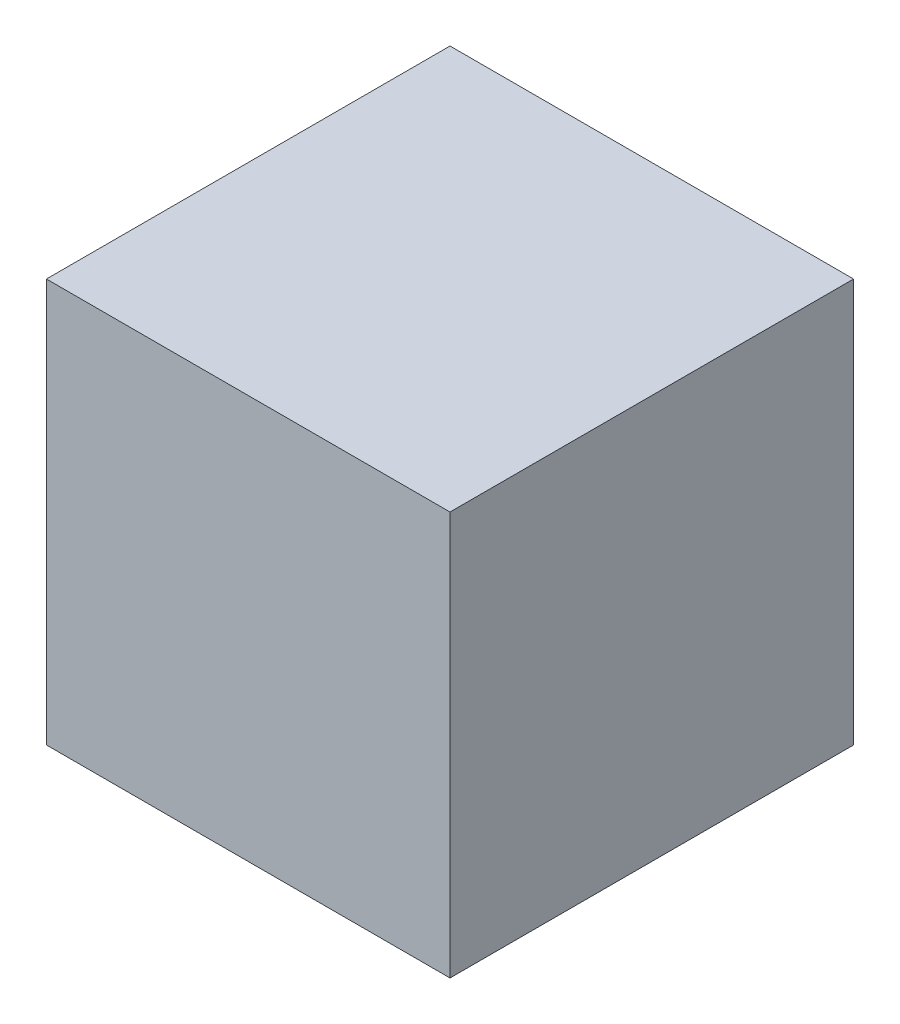
ISO-10303-21;
HEADER;
FILE_DESCRIPTION(('STEP AP214'),'2;1');
FILE_NAME('part.step','',(''),(''),'','','');
FILE_SCHEMA(('AUTOMOTIVE_DESIGN { 1 0 10303 214 1 1 1 1 }'));
ENDSEC;
DATA;
#1=APPLICATION_CONTEXT('core data for automotive mechanical design processes');
#2=APPLICATION_PROTOCOL_DEFINITION('international standard','automotive_design',2000,#1);
#3=PRODUCT_CONTEXT('',#1,'mechanical');
#4=PRODUCT('Part','Part','',(#3));
#5=PRODUCT_RELATED_PRODUCT_CATEGORY('part','',(#4));
#6=PRODUCT_DEFINITION_FORMATION('','',#4);
#7=PRODUCT_DEFINITION_CONTEXT('part definition',#1,'design');
#8=PRODUCT_DEFINITION('design','',#6,#7);
#9=PRODUCT_DEFINITION_SHAPE('','',#8);
#10=(LENGTH_UNIT() NAMED_UNIT(*) SI_UNIT(.MILLI.,.METRE.));
#11=(NAMED_UNIT(*) PLANE_ANGLE_UNIT() SI_UNIT($,.RADIAN.));
#12=(NAMED_UNIT(*) SI_UNIT($,.STERADIAN.) SOLID_ANGLE_UNIT());
#13=UNCERTAINTY_MEASURE_WITH_UNIT(LENGTH_MEASURE(1.E-05),#10,'distance_accuracy_value','');
#14=(GEOMETRIC_REPRESENTATION_CONTEXT(3) GLOBAL_UNCERTAINTY_ASSIGNED_CONTEXT((#13)) GLOBAL_UNIT_ASSIGNED_CONTEXT((#10,
#11,#12)) REPRESENTATION_CONTEXT('',''));
#15=CARTESIAN_POINT('',(0.,0.,0.));
#16=DIRECTION('',(0.,0.,1.));
#17=DIRECTION('',(1.,0.,0.));
#18=AXIS2_PLACEMENT_3D('',#15,#16,#17);
#19=CARTESIAN_POINT('',(-75.,150.,75.));
#20=DIRECTION('',(1.,0.,0.));
#21=DIRECTION('',(0.,0.,-1.));
#22=AXIS2_PLACEMENT_3D('',#19,#20,#21);
#23=PLANE('',#22);
#24=DIRECTION('',(0.,0.,1.));
#25=VECTOR('',#24,1.);
#26=CARTESIAN_POINT('',(-75.,0.,75.));
#27=LINE('',#26,#25);
#28=CARTESIAN_POINT('',(-75.,0.,-75.));
#29=VERTEX_POINT('',#28);
#30=CARTESIAN_POINT('',(-75.,0.,75.));
#31=VERTEX_POINT('',#30);
#32=EDGE_CURVE('E95',#29,#31,#27,.T.);
#33=ORIENTED_EDGE('',*,*,#32,.T.);
#34=DIRECTION('',(0.,-1.,0.));
#35=VECTOR('',#34,1.);
#36=CARTESIAN_POINT('',(-75.,150.,75.));
#37=LINE('',#36,#35);
#38=CARTESIAN_POINT('',(-75.,150.,75.));
#39=VERTEX_POINT('',#38);
#40=EDGE_CURVE('E11',#39,#31,#37,.T.);
#41=ORIENTED_EDGE('',*,*,#40,.F.);
#42=DIRECTION('',(0.,0.,1.));
#43=VECTOR('',#42,1.);
#44=CARTESIAN_POINT('',(-75.,150.,75.));
#45=LINE('',#44,#43);
#46=CARTESIAN_POINT('',(-75.,150.,-75.));
#47=VERTEX_POINT('',#46);
#48=EDGE_CURVE('E83',#47,#39,#45,.T.);
#49=ORIENTED_EDGE('',*,*,#48,.F.);
#50=DIRECTION('',(0.,-1.,0.));
#51=VECTOR('',#50,1.);
#52=CARTESIAN_POINT('',(-75.,150.,-75.));
#53=LINE('',#52,#51);
#54=EDGE_CURVE('E91',#47,#29,#53,.T.);
#55=ORIENTED_EDGE('',*,*,#54,.T.);
#56=EDGE_LOOP('',(#33,#41,#49,#55));
#57=FACE_BOUND('',#56,.T.);
#58=ADVANCED_FACE('F32',(#57),#23,.F.);
#59=CARTESIAN_POINT('',(75.,150.,75.));
#60=DIRECTION('',(0.,0.,-1.));
#61=DIRECTION('',(-1.,0.,0.));
#62=AXIS2_PLACEMENT_3D('',#59,#60,#61);
#63=PLANE('',#62);
#64=DIRECTION('',(1.,0.,0.));
#65=VECTOR('',#64,1.);
#66=CARTESIAN_POINT('',(75.,0.,75.));
#67=LINE('',#66,#65);
#68=CARTESIAN_POINT('',(75.,0.,75.));
#69=VERTEX_POINT('',#68);
#70=EDGE_CURVE('E87',#31,#69,#67,.T.);
#71=ORIENTED_EDGE('',*,*,#70,.T.);
#72=DIRECTION('',(0.,-1.,0.));
#73=VECTOR('',#72,1.);
#74=CARTESIAN_POINT('',(75.,150.,75.));
#75=LINE('',#74,#73);
#76=CARTESIAN_POINT('',(75.,150.,75.));
#77=VERTEX_POINT('',#76);
#78=EDGE_CURVE('E40',#77,#69,#75,.T.);
#79=ORIENTED_EDGE('',*,*,#78,.F.);
#80=DIRECTION('',(1.,0.,0.));
#81=VECTOR('',#80,1.);
#82=CARTESIAN_POINT('',(75.,150.,75.));
#83=LINE('',#82,#81);
#84=EDGE_CURVE('E78',#39,#77,#83,.T.);
#85=ORIENTED_EDGE('',*,*,#84,.F.);
#86=ORIENTED_EDGE('',*,*,#40,.T.);
#87=EDGE_LOOP('',(#71,#79,#85,#86));
#88=FACE_BOUND('',#87,.T.);
#89=ADVANCED_FACE('F86',(#88),#63,.F.);
#90=CARTESIAN_POINT('',(75.,150.,75.));
#91=DIRECTION('',(-1.,0.,0.));
#92=DIRECTION('',(0.,0.,1.));
#93=AXIS2_PLACEMENT_3D('',#90,#91,#92);
#94=PLANE('',#93);
#95=DIRECTION('',(0.,0.,-1.));
#96=VECTOR('',#95,1.);
#97=CARTESIAN_POINT('',(75.,0.,75.));
#98=LINE('',#97,#96);
#99=CARTESIAN_POINT('',(75.,0.,-75.));
#100=VERTEX_POINT('',#99);
#101=EDGE_CURVE('E65',#69,#100,#98,.T.);
#102=ORIENTED_EDGE('',*,*,#101,.T.);
#103=DIRECTION('',(0.,-1.,0.));
#104=VECTOR('',#103,1.);
#105=CARTESIAN_POINT('',(75.,150.,-75.));
#106=LINE('',#105,#104);
#107=CARTESIAN_POINT('',(75.,150.,-75.));
#108=VERTEX_POINT('',#107);
#109=EDGE_CURVE('E88',#108,#100,#106,.T.);
#110=ORIENTED_EDGE('',*,*,#109,.F.);
#111=DIRECTION('',(0.,0.,-1.));
#112=VECTOR('',#111,1.);
#113=CARTESIAN_POINT('',(75.,150.,75.));
#114=LINE('',#113,#112);
#115=EDGE_CURVE('E81',#77,#108,#114,.T.);
#116=ORIENTED_EDGE('',*,*,#115,.F.);
#117=ORIENTED_EDGE('',*,*,#78,.T.);
#118=EDGE_LOOP('',(#102,#110,#116,#117));
#119=FACE_BOUND('',#118,.T.);
#120=ADVANCED_FACE('F89',(#119),#94,.F.);
#121=CARTESIAN_POINT('',(75.,150.,-75.));
#122=DIRECTION('',(0.,0.,1.));
#123=DIRECTION('',(1.,0.,0.));
#124=AXIS2_PLACEMENT_3D('',#121,#122,#123);
#125=PLANE('',#124);
#126=DIRECTION('',(-1.,0.,0.));
#127=VECTOR('',#126,1.);
#128=CARTESIAN_POINT('',(75.,0.,-75.));
#129=LINE('',#128,#127);
#130=EDGE_CURVE('E71',#100,#29,#129,.T.);
#131=ORIENTED_EDGE('',*,*,#130,.T.);
#132=ORIENTED_EDGE('',*,*,#54,.F.);
#133=DIRECTION('',(-1.,0.,0.));
#134=VECTOR('',#133,1.);
#135=CARTESIAN_POINT('',(75.,150.,-75.));
#136=LINE('',#135,#134);
#137=EDGE_CURVE('E48',#108,#47,#136,.T.);
#138=ORIENTED_EDGE('',*,*,#137,.F.);
#139=ORIENTED_EDGE('',*,*,#109,.T.);
#140=EDGE_LOOP('',(#131,#132,#138,#139));
#141=FACE_BOUND('',#140,.T.);
#142=ADVANCED_FACE('F102',(#141),#125,.F.);
#143=CARTESIAN_POINT('',(0.,150.,0.));
#144=DIRECTION('',(0.,1.,0.));
#145=DIRECTION('',(0.,0.,1.));
#146=AXIS2_PLACEMENT_3D('',#143,#144,#145);
#147=PLANE('',#146);
#148=ORIENTED_EDGE('',*,*,#48,.T.);
#149=ORIENTED_EDGE('',*,*,#84,.T.);
#150=ORIENTED_EDGE('',*,*,#115,.T.);
#151=ORIENTED_EDGE('',*,*,#137,.T.);
#152=EDGE_LOOP('',(#148,#149,#150,#151));
#153=FACE_BOUND('',#152,.T.);
#154=ADVANCED_FACE('F79',(#153),#147,.T.);
#155=CARTESIAN_POINT('',(0.,0.,0.));
#156=DIRECTION('',(0.,1.,0.));
#157=DIRECTION('',(0.,0.,1.));
#158=AXIS2_PLACEMENT_3D('',#155,#156,#157);
#159=PLANE('',#158);
#160=ORIENTED_EDGE('',*,*,#32,.F.);
#161=ORIENTED_EDGE('',*,*,#130,.F.);
#162=ORIENTED_EDGE('',*,*,#101,.F.);
#163=ORIENTED_EDGE('',*,*,#70,.F.);
#164=EDGE_LOOP('',(#160,#161,#162,#163));
#165=FACE_BOUND('',#164,.T.);
#166=ADVANCED_FACE('F105',(#165),#159,.F.);
#167=CLOSED_SHELL('',(#58,#89,#120,#142,#154,#166));
#168=MANIFOLD_SOLID_BREP('B2',#167);
#169=ADVANCED_BREP_SHAPE_REPRESENTATION('',(#18,#168),#14);
#170=SHAPE_DEFINITION_REPRESENTATION(#9,#169);
ENDSEC;
END-ISO-10303-21;
